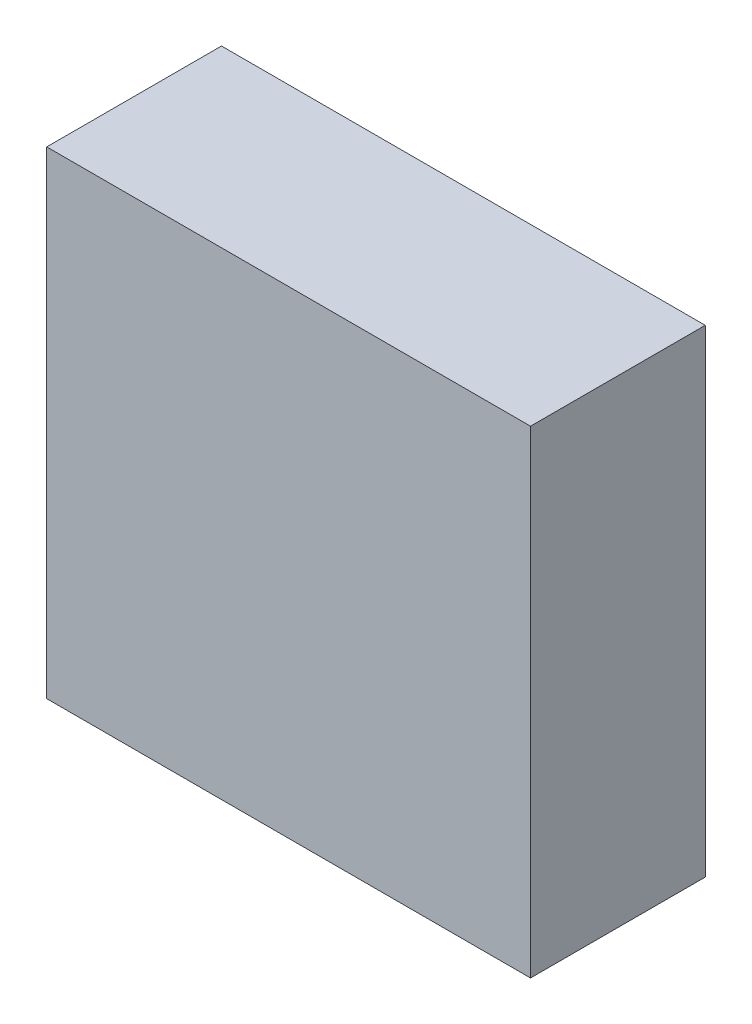
ISO-10303-21;
HEADER;
FILE_DESCRIPTION(('STEP AP214'),'2;1');
FILE_NAME('part.step','',(''),(''),'','','');
FILE_SCHEMA(('AUTOMOTIVE_DESIGN { 1 0 10303 214 1 1 1 1 }'));
ENDSEC;
DATA;
#1=APPLICATION_CONTEXT('core data for automotive mechanical design processes');
#2=APPLICATION_PROTOCOL_DEFINITION('international standard','automotive_design',2000,#1);
#3=PRODUCT_CONTEXT('',#1,'mechanical');
#4=PRODUCT('Part','Part','',(#3));
#5=PRODUCT_RELATED_PRODUCT_CATEGORY('part','',(#4));
#6=PRODUCT_DEFINITION_FORMATION('','',#4);
#7=PRODUCT_DEFINITION_CONTEXT('part definition',#1,'design');
#8=PRODUCT_DEFINITION('design','',#6,#7);
#9=PRODUCT_DEFINITION_SHAPE('','',#8);
#10=(LENGTH_UNIT() NAMED_UNIT(*) SI_UNIT(.MILLI.,.METRE.));
#11=(NAMED_UNIT(*) PLANE_ANGLE_UNIT() SI_UNIT($,.RADIAN.));
#12=(NAMED_UNIT(*) SI_UNIT($,.STERADIAN.) SOLID_ANGLE_UNIT());
#13=UNCERTAINTY_MEASURE_WITH_UNIT(LENGTH_MEASURE(1.E-05),#10,'distance_accuracy_value','');
#14=(GEOMETRIC_REPRESENTATION_CONTEXT(3) GLOBAL_UNCERTAINTY_ASSIGNED_CONTEXT((#13)) GLOBAL_UNIT_ASSIGNED_CONTEXT((#10,
#11,#12)) REPRESENTATION_CONTEXT('',''));
#15=CARTESIAN_POINT('',(0.,0.,0.));
#16=DIRECTION('',(0.,0.,1.));
#17=DIRECTION('',(1.,0.,0.));
#18=AXIS2_PLACEMENT_3D('',#15,#16,#17);
#19=CARTESIAN_POINT('',(0.1435,-1.34,0.99));
#20=DIRECTION('',(0.,0.,1.));
#21=DIRECTION('',(1.,0.,0.));
#22=AXIS2_PLACEMENT_3D('',#19,#20,#21);
#23=PLANE('',#22);
#24=DIRECTION('',(0.,1.,0.));
#25=VECTOR('',#24,1.);
#26=CARTESIAN_POINT('',(2.8565,-1.34,0.99));
#27=LINE('',#26,#25);
#28=CARTESIAN_POINT('',(2.8565,1.34,0.99));
#29=VERTEX_POINT('',#28);
#30=CARTESIAN_POINT('',(2.8565,-1.34,0.99));
#31=VERTEX_POINT('',#30);
#32=EDGE_CURVE('E76',#29,#31,#27,.F.);
#33=ORIENTED_EDGE('',*,*,#32,.F.);
#34=DIRECTION('',(1.,0.,0.));
#35=VECTOR('',#34,1.);
#36=CARTESIAN_POINT('',(0.1435,1.34,0.99));
#37=LINE('',#36,#35);
#38=CARTESIAN_POINT('',(0.1435,1.34,0.99));
#39=VERTEX_POINT('',#38);
#40=EDGE_CURVE('E58',#39,#29,#37,.T.);
#41=ORIENTED_EDGE('',*,*,#40,.F.);
#42=DIRECTION('',(0.,1.,0.));
#43=VECTOR('',#42,1.);
#44=CARTESIAN_POINT('',(0.1435,-1.34,0.99));
#45=LINE('',#44,#43);
#46=CARTESIAN_POINT('',(0.1435,-1.34,0.99));
#47=VERTEX_POINT('',#46);
#48=EDGE_CURVE('E20',#39,#47,#45,.F.);
#49=ORIENTED_EDGE('',*,*,#48,.T.);
#50=DIRECTION('',(1.,0.,0.));
#51=VECTOR('',#50,1.);
#52=CARTESIAN_POINT('',(0.1435,-1.34,0.99));
#53=LINE('',#52,#51);
#54=EDGE_CURVE('E55',#47,#31,#53,.T.);
#55=ORIENTED_EDGE('',*,*,#54,.T.);
#56=EDGE_LOOP('',(#33,#41,#49,#55));
#57=FACE_BOUND('',#56,.T.);
#58=ADVANCED_FACE('F17',(#57),#23,.T.);
#59=CARTESIAN_POINT('',(0.1435,-1.34,0.01));
#60=DIRECTION('',(1.,0.,0.));
#61=DIRECTION('',(0.,0.,-1.));
#62=AXIS2_PLACEMENT_3D('',#59,#60,#61);
#63=PLANE('',#62);
#64=DIRECTION('',(0.,0.,1.));
#65=VECTOR('',#64,1.);
#66=CARTESIAN_POINT('',(0.1435,1.34,0.01));
#67=LINE('',#66,#65);
#68=CARTESIAN_POINT('',(0.1435,1.34,0.01));
#69=VERTEX_POINT('',#68);
#70=EDGE_CURVE('E78',#69,#39,#67,.T.);
#71=ORIENTED_EDGE('',*,*,#70,.F.);
#72=DIRECTION('',(0.,1.,0.));
#73=VECTOR('',#72,1.);
#74=CARTESIAN_POINT('',(0.1435,-1.34,0.01));
#75=LINE('',#74,#73);
#76=CARTESIAN_POINT('',(0.1435,-1.34,0.01));
#77=VERTEX_POINT('',#76);
#78=EDGE_CURVE('E73',#69,#77,#75,.F.);
#79=ORIENTED_EDGE('',*,*,#78,.T.);
#80=DIRECTION('',(0.,0.,1.));
#81=VECTOR('',#80,1.);
#82=CARTESIAN_POINT('',(0.1435,-1.34,0.01));
#83=LINE('',#82,#81);
#84=EDGE_CURVE('E63',#77,#47,#83,.T.);
#85=ORIENTED_EDGE('',*,*,#84,.T.);
#86=ORIENTED_EDGE('',*,*,#48,.F.);
#87=EDGE_LOOP('',(#71,#79,#85,#86));
#88=FACE_BOUND('',#87,.T.);
#89=ADVANCED_FACE('F72',(#88),#63,.F.);
#90=CARTESIAN_POINT('',(0.1435,-1.34,0.01));
#91=DIRECTION('',(0.,1.,0.));
#92=DIRECTION('',(0.,0.,1.));
#93=AXIS2_PLACEMENT_3D('',#90,#91,#92);
#94=PLANE('',#93);
#95=ORIENTED_EDGE('',*,*,#54,.F.);
#96=ORIENTED_EDGE('',*,*,#84,.F.);
#97=DIRECTION('',(1.,0.,0.));
#98=VECTOR('',#97,1.);
#99=CARTESIAN_POINT('',(0.1435,-1.34,0.01));
#100=LINE('',#99,#98);
#101=CARTESIAN_POINT('',(2.8565,-1.34,0.01));
#102=VERTEX_POINT('',#101);
#103=EDGE_CURVE('E83',#77,#102,#100,.T.);
#104=ORIENTED_EDGE('',*,*,#103,.T.);
#105=DIRECTION('',(0.,0.,-1.));
#106=VECTOR('',#105,1.);
#107=CARTESIAN_POINT('',(2.8565,-1.34,0.01));
#108=LINE('',#107,#106);
#109=EDGE_CURVE('E69',#31,#102,#108,.T.);
#110=ORIENTED_EDGE('',*,*,#109,.F.);
#111=EDGE_LOOP('',(#95,#96,#104,#110));
#112=FACE_BOUND('',#111,.T.);
#113=ADVANCED_FACE('F66',(#112),#94,.F.);
#114=CARTESIAN_POINT('',(2.8565,-1.34,0.01));
#115=DIRECTION('',(1.,0.,0.));
#116=DIRECTION('',(0.,0.,-1.));
#117=AXIS2_PLACEMENT_3D('',#114,#115,#116);
#118=PLANE('',#117);
#119=DIRECTION('',(0.,0.,1.));
#120=VECTOR('',#119,1.);
#121=CARTESIAN_POINT('',(2.8565,1.34,0.01));
#122=LINE('',#121,#120);
#123=CARTESIAN_POINT('',(2.8565,1.34,0.01));
#124=VERTEX_POINT('',#123);
#125=EDGE_CURVE('E34',#29,#124,#122,.F.);
#126=ORIENTED_EDGE('',*,*,#125,.F.);
#127=ORIENTED_EDGE('',*,*,#32,.T.);
#128=ORIENTED_EDGE('',*,*,#109,.T.);
#129=DIRECTION('',(0.,1.,0.));
#130=VECTOR('',#129,1.);
#131=CARTESIAN_POINT('',(2.8565,-1.34,0.01));
#132=LINE('',#131,#130);
#133=EDGE_CURVE('E26',#102,#124,#132,.T.);
#134=ORIENTED_EDGE('',*,*,#133,.T.);
#135=EDGE_LOOP('',(#126,#127,#128,#134));
#136=FACE_BOUND('',#135,.T.);
#137=ADVANCED_FACE('F88',(#136),#118,.T.);
#138=CARTESIAN_POINT('',(0.1435,1.34,0.01));
#139=DIRECTION('',(0.,1.,0.));
#140=DIRECTION('',(0.,0.,1.));
#141=AXIS2_PLACEMENT_3D('',#138,#139,#140);
#142=PLANE('',#141);
#143=ORIENTED_EDGE('',*,*,#40,.T.);
#144=ORIENTED_EDGE('',*,*,#125,.T.);
#145=DIRECTION('',(1.,0.,0.));
#146=VECTOR('',#145,1.);
#147=CARTESIAN_POINT('',(0.1435,1.34,0.01));
#148=LINE('',#147,#146);
#149=EDGE_CURVE('E11',#124,#69,#148,.F.);
#150=ORIENTED_EDGE('',*,*,#149,.T.);
#151=ORIENTED_EDGE('',*,*,#70,.T.);
#152=EDGE_LOOP('',(#143,#144,#150,#151));
#153=FACE_BOUND('',#152,.T.);
#154=ADVANCED_FACE('F91',(#153),#142,.T.);
#155=CARTESIAN_POINT('',(0.1435,-1.34,0.01));
#156=DIRECTION('',(0.,0.,1.));
#157=DIRECTION('',(1.,0.,0.));
#158=AXIS2_PLACEMENT_3D('',#155,#156,#157);
#159=PLANE('',#158);
#160=ORIENTED_EDGE('',*,*,#133,.F.);
#161=ORIENTED_EDGE('',*,*,#103,.F.);
#162=ORIENTED_EDGE('',*,*,#78,.F.);
#163=ORIENTED_EDGE('',*,*,#149,.F.);
#164=EDGE_LOOP('',(#160,#161,#162,#163));
#165=FACE_BOUND('',#164,.T.);
#166=ADVANCED_FACE('F90',(#165),#159,.F.);
#167=CLOSED_SHELL('',(#58,#89,#113,#137,#154,#166));
#168=MANIFOLD_SOLID_BREP('B1',#167);
#169=ADVANCED_BREP_SHAPE_REPRESENTATION('',(#18,#168),#14);
#170=SHAPE_DEFINITION_REPRESENTATION(#9,#169);
ENDSEC;
END-ISO-10303-21;
